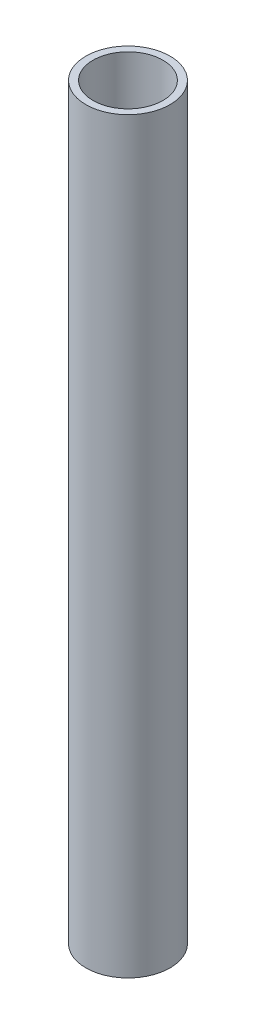
ISO-10303-21;
HEADER;
FILE_DESCRIPTION(('STEP AP214'),'2;1');
FILE_NAME('part.step','',(''),(''),'','','');
FILE_SCHEMA(('AUTOMOTIVE_DESIGN { 1 0 10303 214 1 1 1 1 }'));
ENDSEC;
DATA;
#1=APPLICATION_CONTEXT('core data for automotive mechanical design processes');
#2=APPLICATION_PROTOCOL_DEFINITION('international standard','automotive_design',2000,#1);
#3=PRODUCT_CONTEXT('',#1,'mechanical');
#4=PRODUCT('Part','Part','',(#3));
#5=PRODUCT_RELATED_PRODUCT_CATEGORY('part','',(#4));
#6=PRODUCT_DEFINITION_FORMATION('','',#4);
#7=PRODUCT_DEFINITION_CONTEXT('part definition',#1,'design');
#8=PRODUCT_DEFINITION('design','',#6,#7);
#9=PRODUCT_DEFINITION_SHAPE('','',#8);
#10=(LENGTH_UNIT() NAMED_UNIT(*) SI_UNIT(.MILLI.,.METRE.));
#11=(NAMED_UNIT(*) PLANE_ANGLE_UNIT() SI_UNIT($,.RADIAN.));
#12=(NAMED_UNIT(*) SI_UNIT($,.STERADIAN.) SOLID_ANGLE_UNIT());
#13=UNCERTAINTY_MEASURE_WITH_UNIT(LENGTH_MEASURE(1.E-05),#10,'distance_accuracy_value','');
#14=(GEOMETRIC_REPRESENTATION_CONTEXT(3) GLOBAL_UNCERTAINTY_ASSIGNED_CONTEXT((#13)) GLOBAL_UNIT_ASSIGNED_CONTEXT((#10,
#11,#12)) REPRESENTATION_CONTEXT('',''));
#15=CARTESIAN_POINT('',(0.,0.,0.));
#16=DIRECTION('',(0.,0.,1.));
#17=DIRECTION('',(1.,0.,0.));
#18=AXIS2_PLACEMENT_3D('',#15,#16,#17);
#19=CARTESIAN_POINT('',(0.,374.65,0.));
#20=DIRECTION('',(0.,1.,0.));
#21=DIRECTION('',(0.,0.,1.));
#22=AXIS2_PLACEMENT_3D('',#19,#20,#21);
#23=PLANE('',#22);
#24=CARTESIAN_POINT('',(0.,374.65,0.));
#25=DIRECTION('',(0.,1.,0.));
#26=DIRECTION('',(0.,0.,1.));
#27=AXIS2_PLACEMENT_3D('',#24,#25,#26);
#28=CIRCLE('',#27,21.082);
#29=CARTESIAN_POINT('',(0.,374.65,21.082));
#30=VERTEX_POINT('',#29);
#31=EDGE_CURVE('E10',#30,#30,#28,.T.);
#32=ORIENTED_EDGE('',*,*,#31,.T.);
#33=EDGE_LOOP('',(#32));
#34=FACE_BOUND('',#33,.T.);
#35=CARTESIAN_POINT('',(0.,374.65,0.));
#36=DIRECTION('',(0.,1.,0.));
#37=DIRECTION('',(0.,0.,1.));
#38=AXIS2_PLACEMENT_3D('',#35,#36,#37);
#39=CIRCLE('',#38,17.526);
#40=CARTESIAN_POINT('',(0.,374.65,17.526));
#41=VERTEX_POINT('',#40);
#42=EDGE_CURVE('E42',#41,#41,#39,.T.);
#43=ORIENTED_EDGE('',*,*,#42,.F.);
#44=EDGE_LOOP('',(#43));
#45=FACE_BOUND('',#44,.T.);
#46=ADVANCED_FACE('F31',(#34,#45),#23,.T.);
#47=CARTESIAN_POINT('',(0.,0.,0.));
#48=DIRECTION('',(0.,1.,0.));
#49=DIRECTION('',(0.,0.,1.));
#50=AXIS2_PLACEMENT_3D('',#47,#48,#49);
#51=PLANE('',#50);
#52=CARTESIAN_POINT('',(0.,0.,0.));
#53=DIRECTION('',(0.,1.,0.));
#54=DIRECTION('',(0.,0.,1.));
#55=AXIS2_PLACEMENT_3D('',#52,#53,#54);
#56=CIRCLE('',#55,21.082);
#57=CARTESIAN_POINT('',(0.,0.,21.082));
#58=VERTEX_POINT('',#57);
#59=EDGE_CURVE('E35',#58,#58,#56,.T.);
#60=ORIENTED_EDGE('',*,*,#59,.F.);
#61=EDGE_LOOP('',(#60));
#62=FACE_BOUND('',#61,.T.);
#63=CARTESIAN_POINT('',(0.,0.,0.));
#64=DIRECTION('',(0.,1.,0.));
#65=DIRECTION('',(0.,0.,1.));
#66=AXIS2_PLACEMENT_3D('',#63,#64,#65);
#67=CIRCLE('',#66,17.526);
#68=CARTESIAN_POINT('',(0.,0.,17.526));
#69=VERTEX_POINT('',#68);
#70=EDGE_CURVE('E44',#69,#69,#67,.T.);
#71=ORIENTED_EDGE('',*,*,#70,.T.);
#72=EDGE_LOOP('',(#71));
#73=FACE_BOUND('',#72,.T.);
#74=ADVANCED_FACE('F54',(#62,#73),#51,.F.);
#75=CARTESIAN_POINT('',(0.,374.65,0.));
#76=DIRECTION('',(0.,-1.,0.));
#77=DIRECTION('',(0.,0.,-1.));
#78=AXIS2_PLACEMENT_3D('',#75,#76,#77);
#79=CYLINDRICAL_SURFACE('',#78,21.082);
#80=ORIENTED_EDGE('',*,*,#31,.F.);
#81=EDGE_LOOP('',(#80));
#82=FACE_BOUND('',#81,.T.);
#83=ORIENTED_EDGE('',*,*,#59,.T.);
#84=EDGE_LOOP('',(#83));
#85=FACE_BOUND('',#84,.T.);
#86=ADVANCED_FACE('F33',(#82,#85),#79,.T.);
#87=CARTESIAN_POINT('',(0.,374.65,0.));
#88=DIRECTION('',(0.,-1.,0.));
#89=DIRECTION('',(0.,0.,-1.));
#90=AXIS2_PLACEMENT_3D('',#87,#88,#89);
#91=CYLINDRICAL_SURFACE('',#90,17.526);
#92=ORIENTED_EDGE('',*,*,#42,.T.);
#93=EDGE_LOOP('',(#92));
#94=FACE_BOUND('',#93,.T.);
#95=ORIENTED_EDGE('',*,*,#70,.F.);
#96=EDGE_LOOP('',(#95));
#97=FACE_BOUND('',#96,.T.);
#98=ADVANCED_FACE('F50',(#94,#97),#91,.F.);
#99=CLOSED_SHELL('',(#46,#74,#86,#98));
#100=MANIFOLD_SOLID_BREP('B2',#99);
#101=ADVANCED_BREP_SHAPE_REPRESENTATION('',(#18,#100),#14);
#102=SHAPE_DEFINITION_REPRESENTATION(#9,#101);
ENDSEC;
END-ISO-10303-21;
